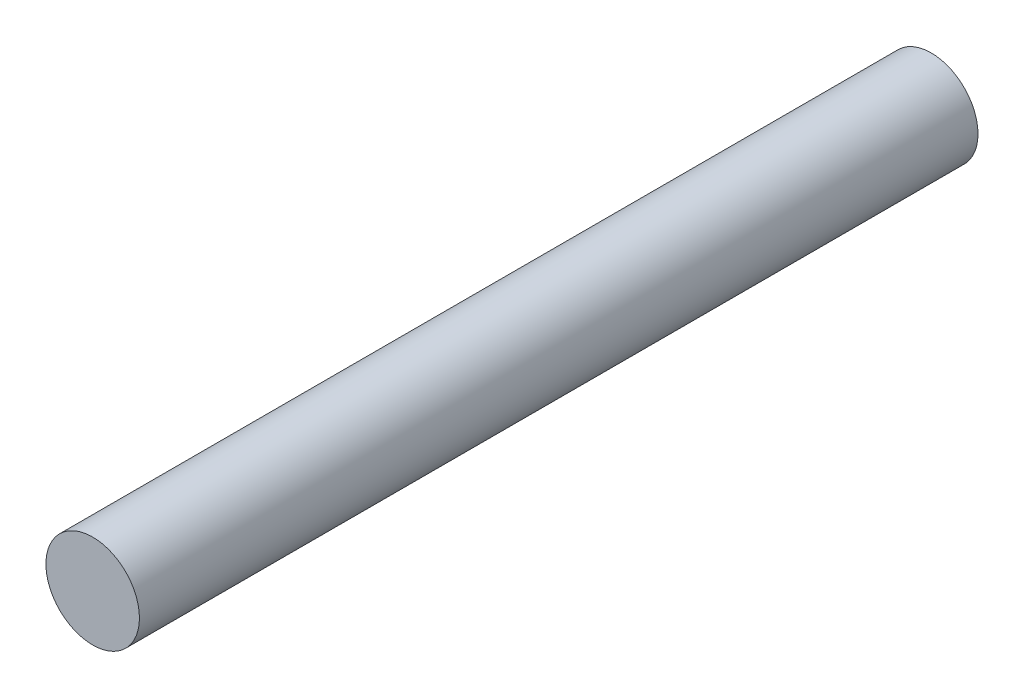
ISO-10303-21;
HEADER;
FILE_DESCRIPTION(('STEP AP214'),'2;1');
FILE_NAME('part.step','',(''),(''),'','','');
FILE_SCHEMA(('AUTOMOTIVE_DESIGN { 1 0 10303 214 1 1 1 1 }'));
ENDSEC;
DATA;
#1=APPLICATION_CONTEXT('core data for automotive mechanical design processes');
#2=APPLICATION_PROTOCOL_DEFINITION('international standard','automotive_design',2000,#1);
#3=PRODUCT_CONTEXT('',#1,'mechanical');
#4=PRODUCT('Part','Part','',(#3));
#5=PRODUCT_RELATED_PRODUCT_CATEGORY('part','',(#4));
#6=PRODUCT_DEFINITION_FORMATION('','',#4);
#7=PRODUCT_DEFINITION_CONTEXT('part definition',#1,'design');
#8=PRODUCT_DEFINITION('design','',#6,#7);
#9=PRODUCT_DEFINITION_SHAPE('','',#8);
#10=(LENGTH_UNIT() NAMED_UNIT(*) SI_UNIT(.MILLI.,.METRE.));
#11=(NAMED_UNIT(*) PLANE_ANGLE_UNIT() SI_UNIT($,.RADIAN.));
#12=(NAMED_UNIT(*) SI_UNIT($,.STERADIAN.) SOLID_ANGLE_UNIT());
#13=UNCERTAINTY_MEASURE_WITH_UNIT(LENGTH_MEASURE(1.E-05),#10,'distance_accuracy_value','');
#14=(GEOMETRIC_REPRESENTATION_CONTEXT(3) GLOBAL_UNCERTAINTY_ASSIGNED_CONTEXT((#13)) GLOBAL_UNIT_ASSIGNED_CONTEXT((#10,
#11,#12)) REPRESENTATION_CONTEXT('',''));
#15=CARTESIAN_POINT('',(0.,0.,0.));
#16=DIRECTION('',(0.,0.,1.));
#17=DIRECTION('',(1.,0.,0.));
#18=AXIS2_PLACEMENT_3D('',#15,#16,#17);
#19=CARTESIAN_POINT('',(-7.89551489056334,14.0704780129969,71.73));
#20=DIRECTION('',(0.,0.,-1.));
#21=DIRECTION('',(-1.,0.,0.));
#22=AXIS2_PLACEMENT_3D('',#19,#20,#21);
#23=CYLINDRICAL_SURFACE('',#22,4.);
#24=CARTESIAN_POINT('',(-7.89551489056334,14.0704780129969,71.73));
#25=DIRECTION('',(0.,0.,1.));
#26=DIRECTION('',(1.,0.,0.));
#27=AXIS2_PLACEMENT_3D('',#24,#25,#26);
#28=CIRCLE('',#27,4.);
#29=CARTESIAN_POINT('',(-3.89551489056334,14.0704780129969,71.73));
#30=VERTEX_POINT('',#29);
#31=EDGE_CURVE('E10',#30,#30,#28,.T.);
#32=ORIENTED_EDGE('',*,*,#31,.F.);
#33=EDGE_LOOP('',(#32));
#34=FACE_BOUND('',#33,.T.);
#35=CARTESIAN_POINT('',(-7.89551489056334,14.0704780129969,0.));
#36=DIRECTION('',(0.,0.,1.));
#37=DIRECTION('',(1.,0.,0.));
#38=AXIS2_PLACEMENT_3D('',#35,#36,#37);
#39=CIRCLE('',#38,4.);
#40=CARTESIAN_POINT('',(-3.89551489056334,14.0704780129969,0.));
#41=VERTEX_POINT('',#40);
#42=EDGE_CURVE('E36',#41,#41,#39,.T.);
#43=ORIENTED_EDGE('',*,*,#42,.T.);
#44=EDGE_LOOP('',(#43));
#45=FACE_BOUND('',#44,.T.);
#46=ADVANCED_FACE('F33',(#34,#45),#23,.T.);
#47=CARTESIAN_POINT('',(-7.89551489056334,14.0704780129969,71.73));
#48=DIRECTION('',(0.,0.,1.));
#49=DIRECTION('',(1.,0.,0.));
#50=AXIS2_PLACEMENT_3D('',#47,#48,#49);
#51=PLANE('',#50);
#52=ORIENTED_EDGE('',*,*,#31,.T.);
#53=EDGE_LOOP('',(#52));
#54=FACE_BOUND('',#53,.T.);
#55=ADVANCED_FACE('F48',(#54),#51,.T.);
#56=CARTESIAN_POINT('',(-7.89551489056334,14.0704780129969,0.));
#57=DIRECTION('',(0.,0.,1.));
#58=DIRECTION('',(1.,0.,0.));
#59=AXIS2_PLACEMENT_3D('',#56,#57,#58);
#60=PLANE('',#59);
#61=ORIENTED_EDGE('',*,*,#42,.F.);
#62=EDGE_LOOP('',(#61));
#63=FACE_BOUND('',#62,.T.);
#64=ADVANCED_FACE('F46',(#63),#60,.F.);
#65=CLOSED_SHELL('',(#46,#55,#64));
#66=MANIFOLD_SOLID_BREP('B2',#65);
#67=ADVANCED_BREP_SHAPE_REPRESENTATION('',(#18,#66),#14);
#68=SHAPE_DEFINITION_REPRESENTATION(#9,#67);
ENDSEC;
END-ISO-10303-21;
